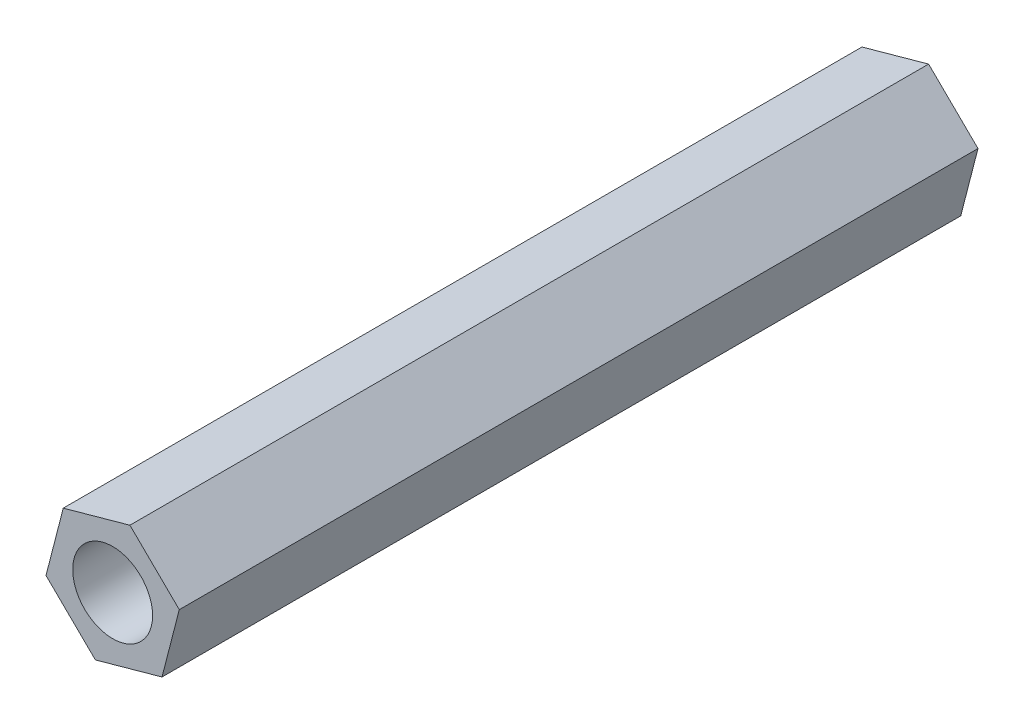
ISO-10303-21;
HEADER;
FILE_DESCRIPTION(('STEP AP214'),'2;1');
FILE_NAME('part.step','',(''),(''),'','','');
FILE_SCHEMA(('AUTOMOTIVE_DESIGN { 1 0 10303 214 1 1 1 1 }'));
ENDSEC;
DATA;
#1=APPLICATION_CONTEXT('core data for automotive mechanical design processes');
#2=APPLICATION_PROTOCOL_DEFINITION('international standard','automotive_design',2000,#1);
#3=PRODUCT_CONTEXT('',#1,'mechanical');
#4=PRODUCT('Part','Part','',(#3));
#5=PRODUCT_RELATED_PRODUCT_CATEGORY('part','',(#4));
#6=PRODUCT_DEFINITION_FORMATION('','',#4);
#7=PRODUCT_DEFINITION_CONTEXT('part definition',#1,'design');
#8=PRODUCT_DEFINITION('design','',#6,#7);
#9=PRODUCT_DEFINITION_SHAPE('','',#8);
#10=(LENGTH_UNIT() NAMED_UNIT(*) SI_UNIT(.MILLI.,.METRE.));
#11=(NAMED_UNIT(*) PLANE_ANGLE_UNIT() SI_UNIT($,.RADIAN.));
#12=(NAMED_UNIT(*) SI_UNIT($,.STERADIAN.) SOLID_ANGLE_UNIT());
#13=UNCERTAINTY_MEASURE_WITH_UNIT(LENGTH_MEASURE(1.E-05),#10,'distance_accuracy_value','');
#14=(GEOMETRIC_REPRESENTATION_CONTEXT(3) GLOBAL_UNCERTAINTY_ASSIGNED_CONTEXT((#13)) GLOBAL_UNIT_ASSIGNED_CONTEXT((#10,
#11,#12)) REPRESENTATION_CONTEXT('',''));
#15=CARTESIAN_POINT('',(0.,0.,0.));
#16=DIRECTION('',(0.,0.,1.));
#17=DIRECTION('',(1.,0.,0.));
#18=AXIS2_PLACEMENT_3D('',#15,#16,#17);
#19=CARTESIAN_POINT('',(-0.4326330238132,-1.67714896974188,20.));
#20=DIRECTION('',(-0.267834692669189,0.963464881250376,0.));
#21=DIRECTION('',(-0.963464881250376,-0.267834692669189,0.));
#22=AXIS2_PLACEMENT_3D('',#19,#20,#21);
#23=PLANE('',#22);
#24=DIRECTION('',(0.963464881250376,0.267834692669189,0.));
#25=VECTOR('',#24,1.);
#26=CARTESIAN_POINT('',(-0.4326330238132,-1.67714896974188,0.));
#27=LINE('',#26,#25);
#28=CARTESIAN_POINT('',(-0.4326330238132,-1.67714896974188,0.));
#29=VERTEX_POINT('',#28);
#30=CARTESIAN_POINT('',(1.23613710182077,-1.21324567400925,0.));
#31=VERTEX_POINT('',#30);
#32=EDGE_CURVE('E118',#29,#31,#27,.T.);
#33=ORIENTED_EDGE('',*,*,#32,.T.);
#34=DIRECTION('',(0.,0.,-1.));
#35=VECTOR('',#34,1.);
#36=CARTESIAN_POINT('',(1.23613710182077,-1.21324567400925,20.));
#37=LINE('',#36,#35);
#38=CARTESIAN_POINT('',(1.23613710182077,-1.21324567400925,20.));
#39=VERTEX_POINT('',#38);
#40=EDGE_CURVE('E11',#39,#31,#37,.T.);
#41=ORIENTED_EDGE('',*,*,#40,.F.);
#42=DIRECTION('',(0.963464881250376,0.267834692669189,0.));
#43=VECTOR('',#42,1.);
#44=CARTESIAN_POINT('',(-0.4326330238132,-1.67714896974188,20.));
#45=LINE('',#44,#43);
#46=CARTESIAN_POINT('',(-0.4326330238132,-1.67714896974188,20.));
#47=VERTEX_POINT('',#46);
#48=EDGE_CURVE('E129',#47,#39,#45,.T.);
#49=ORIENTED_EDGE('',*,*,#48,.F.);
#50=DIRECTION('',(0.,0.,-1.));
#51=VECTOR('',#50,1.);
#52=CARTESIAN_POINT('',(-0.4326330238132,-1.67714896974188,20.));
#53=LINE('',#52,#51);
#54=EDGE_CURVE('E114',#47,#29,#53,.T.);
#55=ORIENTED_EDGE('',*,*,#54,.T.);
#56=EDGE_LOOP('',(#33,#41,#49,#55));
#57=FACE_BOUND('',#56,.T.);
#58=ADVANCED_FACE('F34',(#57),#23,.F.);
#59=CARTESIAN_POINT('',(1.23613710182077,-1.21324567400925,20.));
#60=DIRECTION('',(-0.968302409151578,0.249780792758872,0.));
#61=DIRECTION('',(-0.249780792758872,-0.968302409151578,0.));
#62=AXIS2_PLACEMENT_3D('',#59,#60,#61);
#63=PLANE('',#62);
#64=DIRECTION('',(0.249780792758872,0.968302409151578,0.));
#65=VECTOR('',#64,1.);
#66=CARTESIAN_POINT('',(1.23613710182077,-1.21324567400925,0.));
#67=LINE('',#66,#65);
#68=CARTESIAN_POINT('',(1.66877012563397,0.463903295732631,0.));
#69=VERTEX_POINT('',#68);
#70=EDGE_CURVE('E121',#31,#69,#67,.T.);
#71=ORIENTED_EDGE('',*,*,#70,.T.);
#72=DIRECTION('',(0.,0.,-1.));
#73=VECTOR('',#72,1.);
#74=CARTESIAN_POINT('',(1.66877012563397,0.463903295732631,20.));
#75=LINE('',#74,#73);
#76=CARTESIAN_POINT('',(1.66877012563397,0.463903295732631,20.));
#77=VERTEX_POINT('',#76);
#78=EDGE_CURVE('E42',#77,#69,#75,.T.);
#79=ORIENTED_EDGE('',*,*,#78,.F.);
#80=DIRECTION('',(0.249780792758872,0.968302409151578,0.));
#81=VECTOR('',#80,1.);
#82=CARTESIAN_POINT('',(1.23613710182077,-1.21324567400925,20.));
#83=LINE('',#82,#81);
#84=EDGE_CURVE('E87',#39,#77,#83,.T.);
#85=ORIENTED_EDGE('',*,*,#84,.F.);
#86=ORIENTED_EDGE('',*,*,#40,.T.);
#87=EDGE_LOOP('',(#71,#79,#85,#86));
#88=FACE_BOUND('',#87,.T.);
#89=ADVANCED_FACE('F154',(#88),#63,.F.);
#90=CARTESIAN_POINT('',(1.66877012563397,0.463903295732631,20.));
#91=DIRECTION('',(-0.700467716482389,-0.713684088491503,0.));
#92=DIRECTION('',(0.713684088491503,-0.700467716482389,0.));
#93=AXIS2_PLACEMENT_3D('',#90,#91,#92);
#94=PLANE('',#93);
#95=DIRECTION('',(-0.713684088491503,0.700467716482389,0.));
#96=VECTOR('',#95,1.);
#97=CARTESIAN_POINT('',(1.66877012563397,0.463903295732631,0.));
#98=LINE('',#97,#96);
#99=CARTESIAN_POINT('',(0.4326330238132,1.67714896974188,0.));
#100=VERTEX_POINT('',#99);
#101=EDGE_CURVE('E124',#69,#100,#98,.T.);
#102=ORIENTED_EDGE('',*,*,#101,.T.);
#103=DIRECTION('',(0.,0.,-1.));
#104=VECTOR('',#103,1.);
#105=CARTESIAN_POINT('',(0.4326330238132,1.67714896974188,20.));
#106=LINE('',#105,#104);
#107=CARTESIAN_POINT('',(0.4326330238132,1.67714896974188,20.));
#108=VERTEX_POINT('',#107);
#109=EDGE_CURVE('E109',#108,#100,#106,.T.);
#110=ORIENTED_EDGE('',*,*,#109,.F.);
#111=DIRECTION('',(-0.713684088491503,0.700467716482389,0.));
#112=VECTOR('',#111,1.);
#113=CARTESIAN_POINT('',(1.66877012563397,0.463903295732631,20.));
#114=LINE('',#113,#112);
#115=EDGE_CURVE('E100',#77,#108,#114,.T.);
#116=ORIENTED_EDGE('',*,*,#115,.F.);
#117=ORIENTED_EDGE('',*,*,#78,.T.);
#118=EDGE_LOOP('',(#102,#110,#116,#117));
#119=FACE_BOUND('',#118,.T.);
#120=ADVANCED_FACE('F135',(#119),#94,.F.);
#121=CARTESIAN_POINT('',(0.4326330238132,1.67714896974188,20.));
#122=DIRECTION('',(0.267834692669189,-0.963464881250376,0.));
#123=DIRECTION('',(0.963464881250376,0.267834692669189,0.));
#124=AXIS2_PLACEMENT_3D('',#121,#122,#123);
#125=PLANE('',#124);
#126=DIRECTION('',(-0.963464881250376,-0.267834692669189,0.));
#127=VECTOR('',#126,1.);
#128=CARTESIAN_POINT('',(0.4326330238132,1.67714896974188,0.));
#129=LINE('',#128,#127);
#130=CARTESIAN_POINT('',(-1.23613710182077,1.21324567400925,0.));
#131=VERTEX_POINT('',#130);
#132=EDGE_CURVE('E108',#100,#131,#129,.T.);
#133=ORIENTED_EDGE('',*,*,#132,.T.);
#134=DIRECTION('',(0.,0.,-1.));
#135=VECTOR('',#134,1.);
#136=CARTESIAN_POINT('',(-1.23613710182077,1.21324567400925,20.));
#137=LINE('',#136,#135);
#138=CARTESIAN_POINT('',(-1.23613710182077,1.21324567400925,20.));
#139=VERTEX_POINT('',#138);
#140=EDGE_CURVE('E105',#139,#131,#137,.T.);
#141=ORIENTED_EDGE('',*,*,#140,.F.);
#142=DIRECTION('',(-0.963464881250376,-0.267834692669189,0.));
#143=VECTOR('',#142,1.);
#144=CARTESIAN_POINT('',(0.4326330238132,1.67714896974188,20.));
#145=LINE('',#144,#143);
#146=EDGE_CURVE('E94',#108,#139,#145,.T.);
#147=ORIENTED_EDGE('',*,*,#146,.F.);
#148=ORIENTED_EDGE('',*,*,#109,.T.);
#149=EDGE_LOOP('',(#133,#141,#147,#148));
#150=FACE_BOUND('',#149,.T.);
#151=ADVANCED_FACE('F106',(#150),#125,.F.);
#152=CARTESIAN_POINT('',(-1.23613710182077,1.21324567400925,20.));
#153=DIRECTION('',(0.968302409151578,-0.249780792758873,0.));
#154=DIRECTION('',(0.249780792758873,0.968302409151578,0.));
#155=AXIS2_PLACEMENT_3D('',#152,#153,#154);
#156=PLANE('',#155);
#157=DIRECTION('',(-0.249780792758873,-0.968302409151578,0.));
#158=VECTOR('',#157,1.);
#159=CARTESIAN_POINT('',(-1.23613710182077,1.21324567400925,0.));
#160=LINE('',#159,#158);
#161=CARTESIAN_POINT('',(-1.66877012563397,-0.463903295732631,0.));
#162=VERTEX_POINT('',#161);
#163=EDGE_CURVE('E73',#131,#162,#160,.T.);
#164=ORIENTED_EDGE('',*,*,#163,.T.);
#165=DIRECTION('',(0.,0.,-1.));
#166=VECTOR('',#165,1.);
#167=CARTESIAN_POINT('',(-1.66877012563397,-0.463903295732631,20.));
#168=LINE('',#167,#166);
#169=CARTESIAN_POINT('',(-1.66877012563397,-0.463903295732631,20.));
#170=VERTEX_POINT('',#169);
#171=EDGE_CURVE('E110',#170,#162,#168,.T.);
#172=ORIENTED_EDGE('',*,*,#171,.F.);
#173=DIRECTION('',(-0.249780792758873,-0.968302409151578,0.));
#174=VECTOR('',#173,1.);
#175=CARTESIAN_POINT('',(-1.23613710182077,1.21324567400925,20.));
#176=LINE('',#175,#174);
#177=EDGE_CURVE('E98',#139,#170,#176,.T.);
#178=ORIENTED_EDGE('',*,*,#177,.F.);
#179=ORIENTED_EDGE('',*,*,#140,.T.);
#180=EDGE_LOOP('',(#164,#172,#178,#179));
#181=FACE_BOUND('',#180,.T.);
#182=ADVANCED_FACE('F112',(#181),#156,.F.);
#183=CARTESIAN_POINT('',(-1.66877012563397,-0.463903295732631,20.));
#184=DIRECTION('',(0.700467716482389,0.713684088491503,0.));
#185=DIRECTION('',(-0.713684088491503,0.700467716482389,0.));
#186=AXIS2_PLACEMENT_3D('',#183,#184,#185);
#187=PLANE('',#186);
#188=DIRECTION('',(0.713684088491503,-0.700467716482389,0.));
#189=VECTOR('',#188,1.);
#190=CARTESIAN_POINT('',(-1.66877012563397,-0.463903295732631,0.));
#191=LINE('',#190,#189);
#192=EDGE_CURVE('E79',#162,#29,#191,.T.);
#193=ORIENTED_EDGE('',*,*,#192,.T.);
#194=ORIENTED_EDGE('',*,*,#54,.F.);
#195=DIRECTION('',(0.713684088491503,-0.700467716482389,0.));
#196=VECTOR('',#195,1.);
#197=CARTESIAN_POINT('',(-1.66877012563397,-0.463903295732631,20.));
#198=LINE('',#197,#196);
#199=EDGE_CURVE('E50',#170,#47,#198,.T.);
#200=ORIENTED_EDGE('',*,*,#199,.F.);
#201=ORIENTED_EDGE('',*,*,#171,.T.);
#202=EDGE_LOOP('',(#193,#194,#200,#201));
#203=FACE_BOUND('',#202,.T.);
#204=ADVANCED_FACE('F142',(#203),#187,.F.);
#205=CARTESIAN_POINT('',(0.,0.,20.));
#206=DIRECTION('',(0.,0.,1.));
#207=DIRECTION('',(1.,0.,0.));
#208=AXIS2_PLACEMENT_3D('',#205,#206,#207);
#209=PLANE('',#208);
#210=CARTESIAN_POINT('',(0.,0.,20.));
#211=DIRECTION('',(0.,0.,1.));
#212=DIRECTION('',(1.,0.,0.));
#213=AXIS2_PLACEMENT_3D('',#210,#211,#212);
#214=CIRCLE('',#213,1.);
#215=CARTESIAN_POINT('',(1.,0.,20.));
#216=VERTEX_POINT('',#215);
#217=EDGE_CURVE('E209',#216,#216,#214,.T.);
#218=ORIENTED_EDGE('',*,*,#217,.F.);
#219=EDGE_LOOP('',(#218));
#220=FACE_BOUND('',#219,.T.);
#221=ORIENTED_EDGE('',*,*,#48,.T.);
#222=ORIENTED_EDGE('',*,*,#84,.T.);
#223=ORIENTED_EDGE('',*,*,#115,.T.);
#224=ORIENTED_EDGE('',*,*,#146,.T.);
#225=ORIENTED_EDGE('',*,*,#177,.T.);
#226=ORIENTED_EDGE('',*,*,#199,.T.);
#227=EDGE_LOOP('',(#221,#222,#223,#224,#225,#226));
#228=FACE_BOUND('',#227,.T.);
#229=ADVANCED_FACE('F96',(#220,#228),#209,.T.);
#230=CARTESIAN_POINT('',(0.,0.,0.));
#231=DIRECTION('',(0.,0.,1.));
#232=DIRECTION('',(1.,0.,0.));
#233=AXIS2_PLACEMENT_3D('',#230,#231,#232);
#234=PLANE('',#233);
#235=CARTESIAN_POINT('',(0.,0.,0.));
#236=DIRECTION('',(0.,0.,1.));
#237=DIRECTION('',(1.,0.,0.));
#238=AXIS2_PLACEMENT_3D('',#235,#236,#237);
#239=CIRCLE('',#238,1.);
#240=CARTESIAN_POINT('',(1.,0.,0.));
#241=VERTEX_POINT('',#240);
#242=EDGE_CURVE('E122',#241,#241,#239,.T.);
#243=ORIENTED_EDGE('',*,*,#242,.T.);
#244=EDGE_LOOP('',(#243));
#245=FACE_BOUND('',#244,.T.);
#246=ORIENTED_EDGE('',*,*,#32,.F.);
#247=ORIENTED_EDGE('',*,*,#192,.F.);
#248=ORIENTED_EDGE('',*,*,#163,.F.);
#249=ORIENTED_EDGE('',*,*,#132,.F.);
#250=ORIENTED_EDGE('',*,*,#101,.F.);
#251=ORIENTED_EDGE('',*,*,#70,.F.);
#252=EDGE_LOOP('',(#246,#247,#248,#249,#250,#251));
#253=FACE_BOUND('',#252,.T.);
#254=ADVANCED_FACE('F138',(#245,#253),#234,.F.);
#255=CARTESIAN_POINT('',(0.,0.,0.));
#256=DIRECTION('',(0.,0.,1.));
#257=DIRECTION('',(1.,0.,0.));
#258=AXIS2_PLACEMENT_3D('',#255,#256,#257);
#259=CYLINDRICAL_SURFACE('',#258,1.);
#260=ORIENTED_EDGE('',*,*,#242,.F.);
#261=EDGE_LOOP('',(#260));
#262=FACE_BOUND('',#261,.T.);
#263=ORIENTED_EDGE('',*,*,#217,.T.);
#264=EDGE_LOOP('',(#263));
#265=FACE_BOUND('',#264,.T.);
#266=ADVANCED_FACE('F191',(#262,#265),#259,.F.);
#267=CLOSED_SHELL('',(#58,#89,#120,#151,#182,#204,#229,#254,#266));
#268=MANIFOLD_SOLID_BREP('B2',#267);
#269=ADVANCED_BREP_SHAPE_REPRESENTATION('',(#18,#268),#14);
#270=SHAPE_DEFINITION_REPRESENTATION(#9,#269);
ENDSEC;
END-ISO-10303-21;
